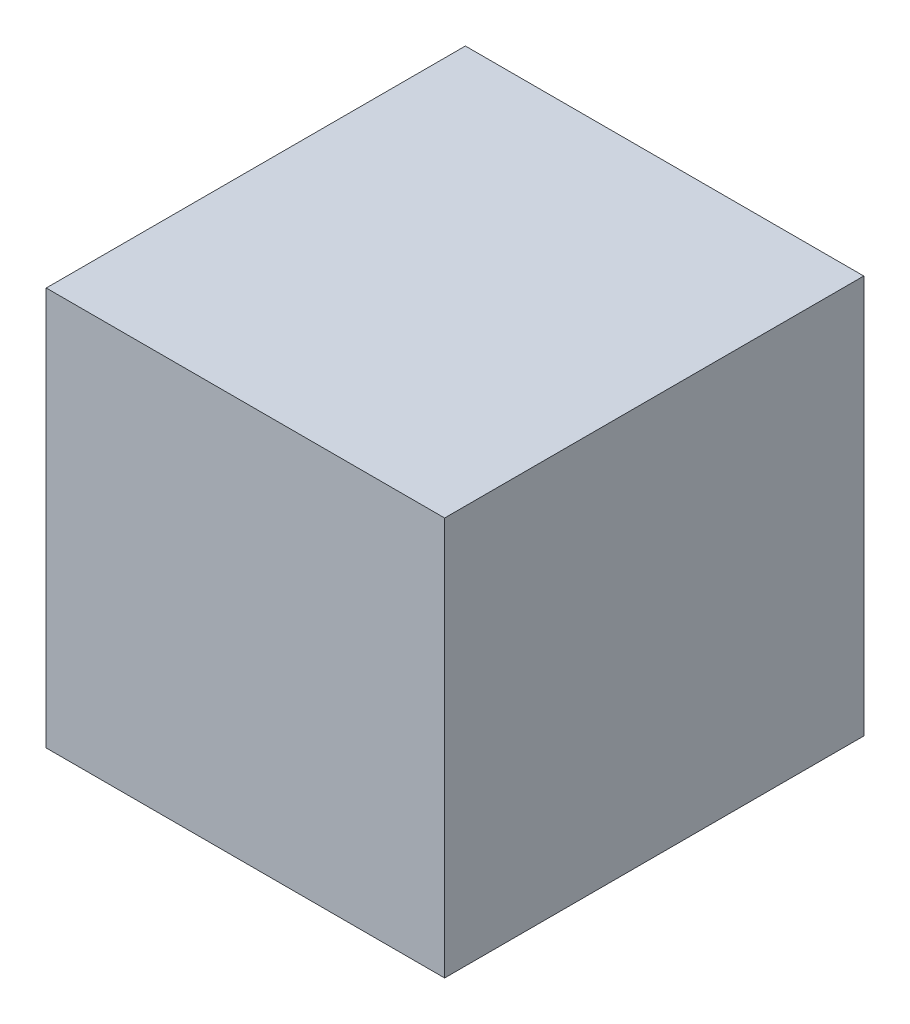
ISO-10303-21;
HEADER;
FILE_DESCRIPTION(('STEP AP214'),'2;1');
FILE_NAME('part.step','',(''),(''),'','','');
FILE_SCHEMA(('AUTOMOTIVE_DESIGN { 1 0 10303 214 1 1 1 1 }'));
ENDSEC;
DATA;
#1=APPLICATION_CONTEXT('core data for automotive mechanical design processes');
#2=APPLICATION_PROTOCOL_DEFINITION('international standard','automotive_design',2000,#1);
#3=PRODUCT_CONTEXT('',#1,'mechanical');
#4=PRODUCT('Part','Part','',(#3));
#5=PRODUCT_RELATED_PRODUCT_CATEGORY('part','',(#4));
#6=PRODUCT_DEFINITION_FORMATION('','',#4);
#7=PRODUCT_DEFINITION_CONTEXT('part definition',#1,'design');
#8=PRODUCT_DEFINITION('design','',#6,#7);
#9=PRODUCT_DEFINITION_SHAPE('','',#8);
#10=(LENGTH_UNIT() NAMED_UNIT(*) SI_UNIT(.MILLI.,.METRE.));
#11=(NAMED_UNIT(*) PLANE_ANGLE_UNIT() SI_UNIT($,.RADIAN.));
#12=(NAMED_UNIT(*) SI_UNIT($,.STERADIAN.) SOLID_ANGLE_UNIT());
#13=UNCERTAINTY_MEASURE_WITH_UNIT(LENGTH_MEASURE(1.E-05),#10,'distance_accuracy_value','');
#14=(GEOMETRIC_REPRESENTATION_CONTEXT(3) GLOBAL_UNCERTAINTY_ASSIGNED_CONTEXT((#13)) GLOBAL_UNIT_ASSIGNED_CONTEXT((#10,
#11,#12)) REPRESENTATION_CONTEXT('',''));
#15=CARTESIAN_POINT('',(0.,0.,0.));
#16=DIRECTION('',(0.,0.,1.));
#17=DIRECTION('',(1.,0.,0.));
#18=AXIS2_PLACEMENT_3D('',#15,#16,#17);
#19=CARTESIAN_POINT('',(0.,0.,-52.5));
#20=DIRECTION('',(0.,0.,1.));
#21=DIRECTION('',(1.,0.,0.));
#22=AXIS2_PLACEMENT_3D('',#19,#20,#21);
#23=PLANE('',#22);
#24=DIRECTION('',(-1.,0.,0.));
#25=VECTOR('',#24,1.);
#26=CARTESIAN_POINT('',(-235.,5.,-52.5));
#27=LINE('',#26,#25);
#28=CARTESIAN_POINT('',(235.,5.,-52.5));
#29=VERTEX_POINT('',#28);
#30=CARTESIAN_POINT('',(-235.,5.,-52.5));
#31=VERTEX_POINT('',#30);
#32=EDGE_CURVE('E182',#29,#31,#27,.T.);
#33=ORIENTED_EDGE('',*,*,#32,.T.);
#34=DIRECTION('',(0.,1.,0.));
#35=VECTOR('',#34,1.);
#36=CARTESIAN_POINT('',(-235.,475.,-52.5));
#37=LINE('',#36,#35);
#38=CARTESIAN_POINT('',(-235.,475.,-52.5));
#39=VERTEX_POINT('',#38);
#40=EDGE_CURVE('E186',#31,#39,#37,.T.);
#41=ORIENTED_EDGE('',*,*,#40,.T.);
#42=DIRECTION('',(1.,0.,0.));
#43=VECTOR('',#42,1.);
#44=CARTESIAN_POINT('',(235.,475.,-52.5));
#45=LINE('',#44,#43);
#46=CARTESIAN_POINT('',(235.,475.,-52.5));
#47=VERTEX_POINT('',#46);
#48=EDGE_CURVE('E191',#39,#47,#45,.T.);
#49=ORIENTED_EDGE('',*,*,#48,.T.);
#50=DIRECTION('',(0.,-1.,0.));
#51=VECTOR('',#50,1.);
#52=CARTESIAN_POINT('',(235.,5.,-52.5));
#53=LINE('',#52,#51);
#54=EDGE_CURVE('E195',#47,#29,#53,.T.);
#55=ORIENTED_EDGE('',*,*,#54,.T.);
#56=EDGE_LOOP('',(#33,#41,#49,#55));
#57=FACE_BOUND('',#56,.T.);
#58=DIRECTION('',(0.,-1.,0.));
#59=VECTOR('',#58,1.);
#60=CARTESIAN_POINT('',(225.,465.,-52.5));
#61=LINE('',#60,#59);
#62=CARTESIAN_POINT('',(225.,465.,-52.5));
#63=VERTEX_POINT('',#62);
#64=CARTESIAN_POINT('',(225.,15.0000000000001,-52.5));
#65=VERTEX_POINT('',#64);
#66=EDGE_CURVE('E135',#63,#65,#61,.T.);
#67=ORIENTED_EDGE('',*,*,#66,.F.);
#68=DIRECTION('',(1.,0.,0.));
#69=VECTOR('',#68,1.);
#70=CARTESIAN_POINT('',(-225.,465.,-52.5));
#71=LINE('',#70,#69);
#72=CARTESIAN_POINT('',(-225.,465.,-52.5));
#73=VERTEX_POINT('',#72);
#74=EDGE_CURVE('E155',#73,#63,#71,.T.);
#75=ORIENTED_EDGE('',*,*,#74,.F.);
#76=DIRECTION('',(0.,-1.,0.));
#77=VECTOR('',#76,1.);
#78=CARTESIAN_POINT('',(-225.,465.,-52.5));
#79=LINE('',#78,#77);
#80=CARTESIAN_POINT('',(-225.,15.,-52.5));
#81=VERTEX_POINT('',#80);
#82=EDGE_CURVE('E55',#73,#81,#79,.T.);
#83=ORIENTED_EDGE('',*,*,#82,.T.);
#84=DIRECTION('',(-1.,0.,0.));
#85=VECTOR('',#84,1.);
#86=CARTESIAN_POINT('',(225.,15.0000000000001,-52.5));
#87=LINE('',#86,#85);
#88=EDGE_CURVE('E169',#65,#81,#87,.T.);
#89=ORIENTED_EDGE('',*,*,#88,.F.);
#90=EDGE_LOOP('',(#67,#75,#83,#89));
#91=FACE_BOUND('',#90,.T.);
#92=ADVANCED_FACE('F38',(#57,#91),#23,.F.);
#93=CARTESIAN_POINT('',(240.,480.,-252.5));
#94=DIRECTION('',(0.,0.,1.));
#95=DIRECTION('',(1.,0.,0.));
#96=AXIS2_PLACEMENT_3D('',#93,#94,#95);
#97=PLANE('',#96);
#98=DIRECTION('',(0.,1.,0.));
#99=VECTOR('',#98,1.);
#100=CARTESIAN_POINT('',(-235.,475.,-252.5));
#101=LINE('',#100,#99);
#102=CARTESIAN_POINT('',(-235.,4.99999999999995,-252.5));
#103=VERTEX_POINT('',#102);
#104=CARTESIAN_POINT('',(-235.,475.,-252.5));
#105=VERTEX_POINT('',#104);
#106=EDGE_CURVE('E202',#103,#105,#101,.T.);
#107=ORIENTED_EDGE('',*,*,#106,.F.);
#108=DIRECTION('',(-1.,0.,0.));
#109=VECTOR('',#108,1.);
#110=CARTESIAN_POINT('',(-235.,5.,-252.5));
#111=LINE('',#110,#109);
#112=CARTESIAN_POINT('',(235.,5.,-252.5));
#113=VERTEX_POINT('',#112);
#114=EDGE_CURVE('E63',#113,#103,#111,.T.);
#115=ORIENTED_EDGE('',*,*,#114,.F.);
#116=DIRECTION('',(0.,-1.,0.));
#117=VECTOR('',#116,1.);
#118=CARTESIAN_POINT('',(235.,5.,-252.5));
#119=LINE('',#118,#117);
#120=CARTESIAN_POINT('',(235.,475.,-252.5));
#121=VERTEX_POINT('',#120);
#122=EDGE_CURVE('E187',#121,#113,#119,.T.);
#123=ORIENTED_EDGE('',*,*,#122,.F.);
#124=DIRECTION('',(1.,0.,0.));
#125=VECTOR('',#124,1.);
#126=CARTESIAN_POINT('',(235.,475.,-252.5));
#127=LINE('',#126,#125);
#128=EDGE_CURVE('E206',#105,#121,#127,.T.);
#129=ORIENTED_EDGE('',*,*,#128,.F.);
#130=EDGE_LOOP('',(#107,#115,#123,#129));
#131=FACE_BOUND('',#130,.T.);
#132=DIRECTION('',(-1.,0.,0.));
#133=VECTOR('',#132,1.);
#134=CARTESIAN_POINT('',(240.,0.,-252.5));
#135=LINE('',#134,#133);
#136=CARTESIAN_POINT('',(240.,0.,-252.5));
#137=VERTEX_POINT('',#136);
#138=CARTESIAN_POINT('',(-240.,0.,-252.5));
#139=VERTEX_POINT('',#138);
#140=EDGE_CURVE('E216',#137,#139,#135,.T.);
#141=ORIENTED_EDGE('',*,*,#140,.T.);
#142=DIRECTION('',(0.,-1.,0.));
#143=VECTOR('',#142,1.);
#144=CARTESIAN_POINT('',(-240.,480.,-252.5));
#145=LINE('',#144,#143);
#146=CARTESIAN_POINT('',(-240.,480.,-252.5));
#147=VERTEX_POINT('',#146);
#148=EDGE_CURVE('E11',#147,#139,#145,.T.);
#149=ORIENTED_EDGE('',*,*,#148,.F.);
#150=DIRECTION('',(-1.,0.,0.));
#151=VECTOR('',#150,1.);
#152=CARTESIAN_POINT('',(240.,480.,-252.5));
#153=LINE('',#152,#151);
#154=CARTESIAN_POINT('',(240.,480.,-252.5));
#155=VERTEX_POINT('',#154);
#156=EDGE_CURVE('E225',#155,#147,#153,.T.);
#157=ORIENTED_EDGE('',*,*,#156,.F.);
#158=DIRECTION('',(0.,-1.,0.));
#159=VECTOR('',#158,1.);
#160=CARTESIAN_POINT('',(240.,480.,-252.5));
#161=LINE('',#160,#159);
#162=EDGE_CURVE('E240',#155,#137,#161,.T.);
#163=ORIENTED_EDGE('',*,*,#162,.T.);
#164=EDGE_LOOP('',(#141,#149,#157,#163));
#165=FACE_BOUND('',#164,.T.);
#166=ADVANCED_FACE('F40',(#131,#165),#97,.F.);
#167=CARTESIAN_POINT('',(-240.,480.,252.5));
#168=DIRECTION('',(-1.,0.,0.));
#169=DIRECTION('',(0.,0.,1.));
#170=AXIS2_PLACEMENT_3D('',#167,#168,#169);
#171=PLANE('',#170);
#172=CARTESIAN_POINT('',(-240.,240.,102.5));
#173=DIRECTION('',(-1.,0.,0.));
#174=DIRECTION('',(0.,0.,1.));
#175=AXIS2_PLACEMENT_3D('',#172,#173,#174);
#176=CIRCLE('',#175,125.);
#177=CARTESIAN_POINT('',(-240.,240.,227.5));
#178=VERTEX_POINT('',#177);
#179=EDGE_CURVE('E161',#178,#178,#176,.T.);
#180=ORIENTED_EDGE('',*,*,#179,.F.);
#181=EDGE_LOOP('',(#180));
#182=FACE_BOUND('',#181,.T.);
#183=DIRECTION('',(0.,0.,-1.));
#184=VECTOR('',#183,1.);
#185=CARTESIAN_POINT('',(-240.,0.,252.5));
#186=LINE('',#185,#184);
#187=CARTESIAN_POINT('',(-240.,0.,252.5));
#188=VERTEX_POINT('',#187);
#189=EDGE_CURVE('E244',#188,#139,#186,.T.);
#190=ORIENTED_EDGE('',*,*,#189,.F.);
#191=DIRECTION('',(0.,-1.,0.));
#192=VECTOR('',#191,1.);
#193=CARTESIAN_POINT('',(-240.,480.,252.5));
#194=LINE('',#193,#192);
#195=CARTESIAN_POINT('',(-240.,480.,252.5));
#196=VERTEX_POINT('',#195);
#197=EDGE_CURVE('E48',#196,#188,#194,.T.);
#198=ORIENTED_EDGE('',*,*,#197,.F.);
#199=DIRECTION('',(0.,0.,-1.));
#200=VECTOR('',#199,1.);
#201=CARTESIAN_POINT('',(-240.,480.,252.5));
#202=LINE('',#201,#200);
#203=EDGE_CURVE('E228',#196,#147,#202,.T.);
#204=ORIENTED_EDGE('',*,*,#203,.T.);
#205=ORIENTED_EDGE('',*,*,#148,.T.);
#206=EDGE_LOOP('',(#190,#198,#204,#205));
#207=FACE_BOUND('',#206,.T.);
#208=ADVANCED_FACE('F268',(#182,#207),#171,.T.);
#209=CARTESIAN_POINT('',(240.,480.,252.5));
#210=DIRECTION('',(0.,0.,1.));
#211=DIRECTION('',(1.,0.,0.));
#212=AXIS2_PLACEMENT_3D('',#209,#210,#211);
#213=PLANE('',#212);
#214=DIRECTION('',(-1.,0.,0.));
#215=VECTOR('',#214,1.);
#216=CARTESIAN_POINT('',(240.,0.,252.5));
#217=LINE('',#216,#215);
#218=CARTESIAN_POINT('',(240.,0.,252.5));
#219=VERTEX_POINT('',#218);
#220=EDGE_CURVE('E248',#219,#188,#217,.T.);
#221=ORIENTED_EDGE('',*,*,#220,.F.);
#222=DIRECTION('',(0.,-1.,0.));
#223=VECTOR('',#222,1.);
#224=CARTESIAN_POINT('',(240.,480.,252.5));
#225=LINE('',#224,#223);
#226=CARTESIAN_POINT('',(240.,480.,252.5));
#227=VERTEX_POINT('',#226);
#228=EDGE_CURVE('E257',#227,#219,#225,.T.);
#229=ORIENTED_EDGE('',*,*,#228,.F.);
#230=DIRECTION('',(-1.,0.,0.));
#231=VECTOR('',#230,1.);
#232=CARTESIAN_POINT('',(240.,480.,252.5));
#233=LINE('',#232,#231);
#234=EDGE_CURVE('E233',#227,#196,#233,.T.);
#235=ORIENTED_EDGE('',*,*,#234,.T.);
#236=ORIENTED_EDGE('',*,*,#197,.T.);
#237=EDGE_LOOP('',(#221,#229,#235,#236));
#238=FACE_BOUND('',#237,.T.);
#239=ADVANCED_FACE('F264',(#238),#213,.T.);
#240=CARTESIAN_POINT('',(240.,480.,252.5));
#241=DIRECTION('',(-1.,0.,0.));
#242=DIRECTION('',(0.,0.,1.));
#243=AXIS2_PLACEMENT_3D('',#240,#241,#242);
#244=PLANE('',#243);
#245=DIRECTION('',(0.,0.,-1.));
#246=VECTOR('',#245,1.);
#247=CARTESIAN_POINT('',(240.,0.,252.5));
#248=LINE('',#247,#246);
#249=EDGE_CURVE('E229',#219,#137,#248,.T.);
#250=ORIENTED_EDGE('',*,*,#249,.T.);
#251=ORIENTED_EDGE('',*,*,#162,.F.);
#252=DIRECTION('',(0.,0.,-1.));
#253=VECTOR('',#252,1.);
#254=CARTESIAN_POINT('',(240.,480.,252.5));
#255=LINE('',#254,#253);
#256=EDGE_CURVE('E237',#227,#155,#255,.T.);
#257=ORIENTED_EDGE('',*,*,#256,.F.);
#258=ORIENTED_EDGE('',*,*,#228,.T.);
#259=EDGE_LOOP('',(#250,#251,#257,#258));
#260=FACE_BOUND('',#259,.T.);
#261=ADVANCED_FACE('F276',(#260),#244,.F.);
#262=CARTESIAN_POINT('',(0.,480.,0.));
#263=DIRECTION('',(0.,-1.,0.));
#264=DIRECTION('',(0.,0.,-1.));
#265=AXIS2_PLACEMENT_3D('',#262,#263,#264);
#266=PLANE('',#265);
#267=ORIENTED_EDGE('',*,*,#156,.T.);
#268=ORIENTED_EDGE('',*,*,#203,.F.);
#269=ORIENTED_EDGE('',*,*,#234,.F.);
#270=ORIENTED_EDGE('',*,*,#256,.T.);
#271=EDGE_LOOP('',(#267,#268,#269,#270));
#272=FACE_BOUND('',#271,.T.);
#273=ADVANCED_FACE('F281',(#272),#266,.F.);
#274=CARTESIAN_POINT('',(0.,0.,0.));
#275=DIRECTION('',(0.,-1.,0.));
#276=DIRECTION('',(0.,0.,-1.));
#277=AXIS2_PLACEMENT_3D('',#274,#275,#276);
#278=PLANE('',#277);
#279=ORIENTED_EDGE('',*,*,#140,.F.);
#280=ORIENTED_EDGE('',*,*,#249,.F.);
#281=ORIENTED_EDGE('',*,*,#220,.T.);
#282=ORIENTED_EDGE('',*,*,#189,.T.);
#283=EDGE_LOOP('',(#279,#280,#281,#282));
#284=FACE_BOUND('',#283,.T.);
#285=ADVANCED_FACE('F273',(#284),#278,.T.);
#286=CARTESIAN_POINT('',(-235.,5.,-52.5));
#287=DIRECTION('',(0.,-1.,0.));
#288=DIRECTION('',(0.,0.,-1.));
#289=AXIS2_PLACEMENT_3D('',#286,#287,#288);
#290=PLANE('',#289);
#291=ORIENTED_EDGE('',*,*,#114,.T.);
#292=DIRECTION('',(0.,0.,-1.));
#293=VECTOR('',#292,1.);
#294=CARTESIAN_POINT('',(-235.,5.,-52.5));
#295=LINE('',#294,#293);
#296=EDGE_CURVE('E199',#31,#103,#295,.T.);
#297=ORIENTED_EDGE('',*,*,#296,.F.);
#298=ORIENTED_EDGE('',*,*,#32,.F.);
#299=DIRECTION('',(0.,0.,-1.));
#300=VECTOR('',#299,1.);
#301=CARTESIAN_POINT('',(235.,5.,-52.5));
#302=LINE('',#301,#300);
#303=EDGE_CURVE('E213',#29,#113,#302,.T.);
#304=ORIENTED_EDGE('',*,*,#303,.T.);
#305=EDGE_LOOP('',(#291,#297,#298,#304));
#306=FACE_BOUND('',#305,.T.);
#307=ADVANCED_FACE('F288',(#306),#290,.F.);
#308=CARTESIAN_POINT('',(235.,5.,-52.5));
#309=DIRECTION('',(1.,0.,0.));
#310=DIRECTION('',(0.,0.,-1.));
#311=AXIS2_PLACEMENT_3D('',#308,#309,#310);
#312=PLANE('',#311);
#313=ORIENTED_EDGE('',*,*,#122,.T.);
#314=ORIENTED_EDGE('',*,*,#303,.F.);
#315=ORIENTED_EDGE('',*,*,#54,.F.);
#316=DIRECTION('',(0.,0.,-1.));
#317=VECTOR('',#316,1.);
#318=CARTESIAN_POINT('',(235.,475.,-52.5));
#319=LINE('',#318,#317);
#320=EDGE_CURVE('E217',#47,#121,#319,.T.);
#321=ORIENTED_EDGE('',*,*,#320,.T.);
#322=EDGE_LOOP('',(#313,#314,#315,#321));
#323=FACE_BOUND('',#322,.T.);
#324=ADVANCED_FACE('F303',(#323),#312,.F.);
#325=CARTESIAN_POINT('',(235.,475.,-52.5));
#326=DIRECTION('',(0.,1.,0.));
#327=DIRECTION('',(0.,0.,1.));
#328=AXIS2_PLACEMENT_3D('',#325,#326,#327);
#329=PLANE('',#328);
#330=ORIENTED_EDGE('',*,*,#128,.T.);
#331=ORIENTED_EDGE('',*,*,#320,.F.);
#332=ORIENTED_EDGE('',*,*,#48,.F.);
#333=DIRECTION('',(0.,0.,-1.));
#334=VECTOR('',#333,1.);
#335=CARTESIAN_POINT('',(-235.,475.,-52.5));
#336=LINE('',#335,#334);
#337=EDGE_CURVE('E220',#39,#105,#336,.T.);
#338=ORIENTED_EDGE('',*,*,#337,.T.);
#339=EDGE_LOOP('',(#330,#331,#332,#338));
#340=FACE_BOUND('',#339,.T.);
#341=ADVANCED_FACE('F306',(#340),#329,.F.);
#342=CARTESIAN_POINT('',(-235.,475.,-52.5));
#343=DIRECTION('',(-1.,0.,0.));
#344=DIRECTION('',(0.,0.,1.));
#345=AXIS2_PLACEMENT_3D('',#342,#343,#344);
#346=PLANE('',#345);
#347=ORIENTED_EDGE('',*,*,#106,.T.);
#348=ORIENTED_EDGE('',*,*,#337,.F.);
#349=ORIENTED_EDGE('',*,*,#40,.F.);
#350=ORIENTED_EDGE('',*,*,#296,.T.);
#351=EDGE_LOOP('',(#347,#348,#349,#350));
#352=FACE_BOUND('',#351,.T.);
#353=ADVANCED_FACE('F310',(#352),#346,.F.);
#354=CARTESIAN_POINT('',(225.,465.,247.5));
#355=DIRECTION('',(1.,0.,0.));
#356=DIRECTION('',(0.,0.,-1.));
#357=AXIS2_PLACEMENT_3D('',#354,#355,#356);
#358=PLANE('',#357);
#359=ORIENTED_EDGE('',*,*,#66,.T.);
#360=DIRECTION('',(0.,0.,-1.));
#361=VECTOR('',#360,1.);
#362=CARTESIAN_POINT('',(225.,15.0000000000001,247.5));
#363=LINE('',#362,#361);
#364=CARTESIAN_POINT('',(225.,15.0000000000001,247.5));
#365=VERTEX_POINT('',#364);
#366=EDGE_CURVE('E128',#365,#65,#363,.T.);
#367=ORIENTED_EDGE('',*,*,#366,.F.);
#368=DIRECTION('',(0.,-1.,0.));
#369=VECTOR('',#368,1.);
#370=CARTESIAN_POINT('',(225.,465.,247.5));
#371=LINE('',#370,#369);
#372=CARTESIAN_POINT('',(225.,465.,247.5));
#373=VERTEX_POINT('',#372);
#374=EDGE_CURVE('E132',#373,#365,#371,.T.);
#375=ORIENTED_EDGE('',*,*,#374,.F.);
#376=DIRECTION('',(0.,0.,-1.));
#377=VECTOR('',#376,1.);
#378=CARTESIAN_POINT('',(225.,465.,247.5));
#379=LINE('',#378,#377);
#380=EDGE_CURVE('E174',#373,#63,#379,.T.);
#381=ORIENTED_EDGE('',*,*,#380,.T.);
#382=EDGE_LOOP('',(#359,#367,#375,#381));
#383=FACE_BOUND('',#382,.T.);
#384=ADVANCED_FACE('F130',(#383),#358,.F.);
#385=CARTESIAN_POINT('',(-225.,465.,247.5));
#386=DIRECTION('',(0.,1.,0.));
#387=DIRECTION('',(0.,0.,1.));
#388=AXIS2_PLACEMENT_3D('',#385,#386,#387);
#389=PLANE('',#388);
#390=ORIENTED_EDGE('',*,*,#74,.T.);
#391=ORIENTED_EDGE('',*,*,#380,.F.);
#392=DIRECTION('',(1.,0.,0.));
#393=VECTOR('',#392,1.);
#394=CARTESIAN_POINT('',(-225.,465.,247.5));
#395=LINE('',#394,#393);
#396=CARTESIAN_POINT('',(-225.,465.,247.5));
#397=VERTEX_POINT('',#396);
#398=EDGE_CURVE('E141',#397,#373,#395,.T.);
#399=ORIENTED_EDGE('',*,*,#398,.F.);
#400=DIRECTION('',(0.,0.,-1.));
#401=VECTOR('',#400,1.);
#402=CARTESIAN_POINT('',(-225.,465.,247.5));
#403=LINE('',#402,#401);
#404=EDGE_CURVE('E177',#397,#73,#403,.T.);
#405=ORIENTED_EDGE('',*,*,#404,.T.);
#406=EDGE_LOOP('',(#390,#391,#399,#405));
#407=FACE_BOUND('',#406,.T.);
#408=ADVANCED_FACE('F338',(#407),#389,.F.);
#409=CARTESIAN_POINT('',(-225.,465.,247.5));
#410=DIRECTION('',(1.,0.,0.));
#411=DIRECTION('',(0.,1.,0.));
#412=AXIS2_PLACEMENT_3D('',#409,#410,#411);
#413=PLANE('',#412);
#414=CARTESIAN_POINT('',(-225.,240.,102.5));
#415=DIRECTION('',(1.,0.,0.));
#416=DIRECTION('',(0.,1.,0.));
#417=AXIS2_PLACEMENT_3D('',#414,#415,#416);
#418=CIRCLE('',#417,125.);
#419=CARTESIAN_POINT('',(-225.,365.,102.5));
#420=VERTEX_POINT('',#419);
#421=EDGE_CURVE('E42',#420,#420,#418,.T.);
#422=ORIENTED_EDGE('',*,*,#421,.F.);
#423=EDGE_LOOP('',(#422));
#424=FACE_BOUND('',#423,.T.);
#425=ORIENTED_EDGE('',*,*,#82,.F.);
#426=ORIENTED_EDGE('',*,*,#404,.F.);
#427=DIRECTION('',(0.,-1.,0.));
#428=VECTOR('',#427,1.);
#429=CARTESIAN_POINT('',(-225.,465.,247.5));
#430=LINE('',#429,#428);
#431=CARTESIAN_POINT('',(-225.,15.,247.5));
#432=VERTEX_POINT('',#431);
#433=EDGE_CURVE('E150',#397,#432,#430,.T.);
#434=ORIENTED_EDGE('',*,*,#433,.T.);
#435=DIRECTION('',(0.,0.,-1.));
#436=VECTOR('',#435,1.);
#437=CARTESIAN_POINT('',(-225.,15.,247.5));
#438=LINE('',#437,#436);
#439=EDGE_CURVE('E140',#432,#81,#438,.T.);
#440=ORIENTED_EDGE('',*,*,#439,.T.);
#441=EDGE_LOOP('',(#425,#426,#434,#440));
#442=FACE_BOUND('',#441,.T.);
#443=ADVANCED_FACE('F344',(#424,#442),#413,.T.);
#444=CARTESIAN_POINT('',(225.,15.0000000000001,247.5));
#445=DIRECTION('',(0.,-1.,0.));
#446=DIRECTION('',(1.,0.,0.));
#447=AXIS2_PLACEMENT_3D('',#444,#445,#446);
#448=PLANE('',#447);
#449=ORIENTED_EDGE('',*,*,#88,.T.);
#450=ORIENTED_EDGE('',*,*,#439,.F.);
#451=DIRECTION('',(-1.,0.,0.));
#452=VECTOR('',#451,1.);
#453=CARTESIAN_POINT('',(225.,15.0000000000001,247.5));
#454=LINE('',#453,#452);
#455=EDGE_CURVE('E145',#365,#432,#454,.T.);
#456=ORIENTED_EDGE('',*,*,#455,.F.);
#457=ORIENTED_EDGE('',*,*,#366,.T.);
#458=EDGE_LOOP('',(#449,#450,#456,#457));
#459=FACE_BOUND('',#458,.T.);
#460=ADVANCED_FACE('F146',(#459),#448,.F.);
#461=CARTESIAN_POINT('',(0.,0.,247.5));
#462=DIRECTION('',(0.,0.,-1.));
#463=DIRECTION('',(-1.,0.,0.));
#464=AXIS2_PLACEMENT_3D('',#461,#462,#463);
#465=PLANE('',#464);
#466=ORIENTED_EDGE('',*,*,#374,.T.);
#467=ORIENTED_EDGE('',*,*,#455,.T.);
#468=ORIENTED_EDGE('',*,*,#433,.F.);
#469=ORIENTED_EDGE('',*,*,#398,.T.);
#470=EDGE_LOOP('',(#466,#467,#468,#469));
#471=FACE_BOUND('',#470,.T.);
#472=ADVANCED_FACE('F152',(#471),#465,.T.);
#473=CARTESIAN_POINT('',(59.9999999999999,240.,102.5));
#474=DIRECTION('',(-1.,0.,0.));
#475=DIRECTION('',(0.,0.,1.));
#476=AXIS2_PLACEMENT_3D('',#473,#474,#475);
#477=CYLINDRICAL_SURFACE('',#476,125.);
#478=ORIENTED_EDGE('',*,*,#421,.T.);
#479=EDGE_LOOP('',(#478));
#480=FACE_BOUND('',#479,.T.);
#481=ORIENTED_EDGE('',*,*,#179,.T.);
#482=EDGE_LOOP('',(#481));
#483=FACE_BOUND('',#482,.T.);
#484=ADVANCED_FACE('F366',(#480,#483),#477,.F.);
#485=CLOSED_SHELL('',(#92,#166,#208,#239,#261,#273,#285,#307,#324,#341,#353,#384,#408,#443,#460,
#472,#484));
#486=MANIFOLD_SOLID_BREP('B2',#485);
#487=ADVANCED_BREP_SHAPE_REPRESENTATION('',(#18,#486),#14);
#488=SHAPE_DEFINITION_REPRESENTATION(#9,#487);
ENDSEC;
END-ISO-10303-21;
